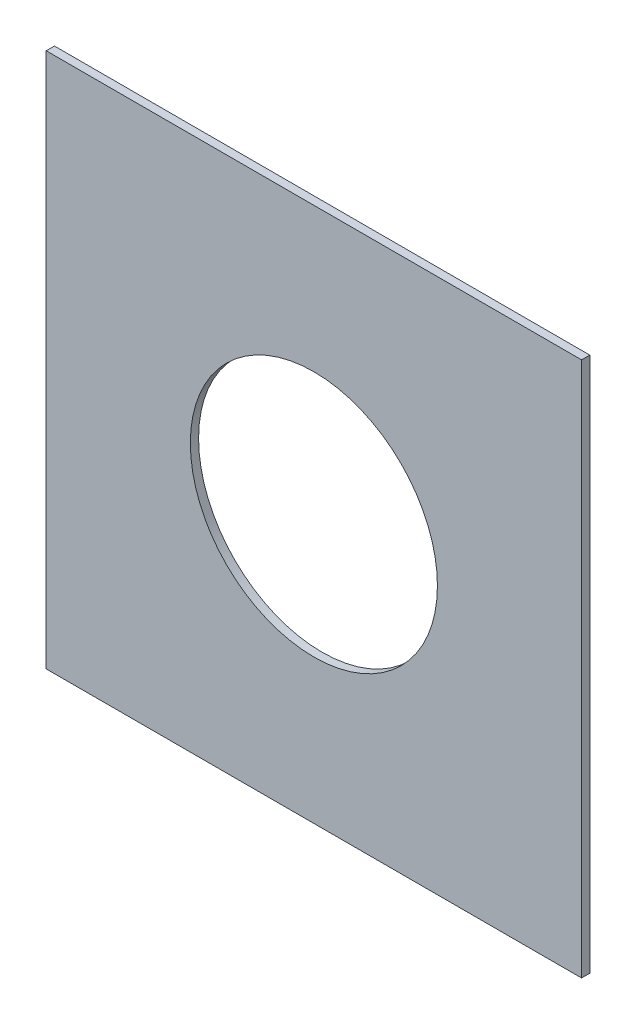
ISO-10303-21;
HEADER;
FILE_DESCRIPTION(('STEP AP214'),'2;1');
FILE_NAME('part.step','',(''),(''),'','','');
FILE_SCHEMA(('AUTOMOTIVE_DESIGN { 1 0 10303 214 1 1 1 1 }'));
ENDSEC;
DATA;
#1=APPLICATION_CONTEXT('core data for automotive mechanical design processes');
#2=APPLICATION_PROTOCOL_DEFINITION('international standard','automotive_design',2000,#1);
#3=PRODUCT_CONTEXT('',#1,'mechanical');
#4=PRODUCT('Part','Part','',(#3));
#5=PRODUCT_RELATED_PRODUCT_CATEGORY('part','',(#4));
#6=PRODUCT_DEFINITION_FORMATION('','',#4);
#7=PRODUCT_DEFINITION_CONTEXT('part definition',#1,'design');
#8=PRODUCT_DEFINITION('design','',#6,#7);
#9=PRODUCT_DEFINITION_SHAPE('','',#8);
#10=(LENGTH_UNIT() NAMED_UNIT(*) SI_UNIT(.MILLI.,.METRE.));
#11=(NAMED_UNIT(*) PLANE_ANGLE_UNIT() SI_UNIT($,.RADIAN.));
#12=(NAMED_UNIT(*) SI_UNIT($,.STERADIAN.) SOLID_ANGLE_UNIT());
#13=UNCERTAINTY_MEASURE_WITH_UNIT(LENGTH_MEASURE(1.E-05),#10,'distance_accuracy_value','');
#14=(GEOMETRIC_REPRESENTATION_CONTEXT(3) GLOBAL_UNCERTAINTY_ASSIGNED_CONTEXT((#13)) GLOBAL_UNIT_ASSIGNED_CONTEXT((#10,
#11,#12)) REPRESENTATION_CONTEXT('',''));
#15=CARTESIAN_POINT('',(0.,0.,0.));
#16=DIRECTION('',(0.,0.,1.));
#17=DIRECTION('',(1.,0.,0.));
#18=AXIS2_PLACEMENT_3D('',#15,#16,#17);
#19=CARTESIAN_POINT('',(3.024,4.85,-6.999));
#20=DIRECTION('',(0.,1.,0.));
#21=DIRECTION('',(1.,0.,0.));
#22=AXIS2_PLACEMENT_3D('',#19,#20,#21);
#23=PLANE('',#22);
#24=DIRECTION('',(0.,0.,1.));
#25=VECTOR('',#24,1.);
#26=CARTESIAN_POINT('',(4.325,4.85,-7.01));
#27=LINE('',#26,#25);
#28=CARTESIAN_POINT('',(4.325,4.85,-7.02));
#29=VERTEX_POINT('',#28);
#30=CARTESIAN_POINT('',(4.325,4.85,-7.));
#31=VERTEX_POINT('',#30);
#32=EDGE_CURVE('E62',#29,#31,#27,.T.);
#33=ORIENTED_EDGE('',*,*,#32,.F.);
#34=DIRECTION('',(1.,0.,0.));
#35=VECTOR('',#34,1.);
#36=CARTESIAN_POINT('',(3.675,4.85,-7.02));
#37=LINE('',#36,#35);
#38=CARTESIAN_POINT('',(3.025,4.85,-7.02));
#39=VERTEX_POINT('',#38);
#40=EDGE_CURVE('E87',#39,#29,#37,.T.);
#41=ORIENTED_EDGE('',*,*,#40,.F.);
#42=DIRECTION('',(0.,0.,-1.));
#43=VECTOR('',#42,1.);
#44=CARTESIAN_POINT('',(3.025,4.85,-7.01));
#45=LINE('',#44,#43);
#46=CARTESIAN_POINT('',(3.025,4.85,-7.));
#47=VERTEX_POINT('',#46);
#48=EDGE_CURVE('E73',#47,#39,#45,.T.);
#49=ORIENTED_EDGE('',*,*,#48,.F.);
#50=DIRECTION('',(-1.,0.,0.));
#51=VECTOR('',#50,1.);
#52=CARTESIAN_POINT('',(3.675,4.85,-7.));
#53=LINE('',#52,#51);
#54=EDGE_CURVE('E56',#31,#47,#53,.T.);
#55=ORIENTED_EDGE('',*,*,#54,.F.);
#56=EDGE_LOOP('',(#33,#41,#49,#55));
#57=FACE_BOUND('',#56,.T.);
#58=ADVANCED_FACE('F17',(#57),#23,.T.);
#59=CARTESIAN_POINT('',(4.325,4.851,-6.999));
#60=DIRECTION('',(1.,0.,0.));
#61=DIRECTION('',(0.,-1.,0.));
#62=AXIS2_PLACEMENT_3D('',#59,#60,#61);
#63=PLANE('',#62);
#64=DIRECTION('',(0.,0.,-1.));
#65=VECTOR('',#64,1.);
#66=CARTESIAN_POINT('',(4.325,3.55,-7.01));
#67=LINE('',#66,#65);
#68=CARTESIAN_POINT('',(4.325,3.55,-7.));
#69=VERTEX_POINT('',#68);
#70=CARTESIAN_POINT('',(4.325,3.55,-7.02));
#71=VERTEX_POINT('',#70);
#72=EDGE_CURVE('E71',#69,#71,#67,.T.);
#73=ORIENTED_EDGE('',*,*,#72,.T.);
#74=DIRECTION('',(0.,-1.,0.));
#75=VECTOR('',#74,1.);
#76=CARTESIAN_POINT('',(4.325,4.2,-7.02));
#77=LINE('',#76,#75);
#78=EDGE_CURVE('E67',#29,#71,#77,.T.);
#79=ORIENTED_EDGE('',*,*,#78,.F.);
#80=ORIENTED_EDGE('',*,*,#32,.T.);
#81=DIRECTION('',(0.,1.,0.));
#82=VECTOR('',#81,1.);
#83=CARTESIAN_POINT('',(4.325,4.2,-7.));
#84=LINE('',#83,#82);
#85=EDGE_CURVE('E64',#69,#31,#84,.T.);
#86=ORIENTED_EDGE('',*,*,#85,.F.);
#87=EDGE_LOOP('',(#73,#79,#80,#86));
#88=FACE_BOUND('',#87,.T.);
#89=ADVANCED_FACE('F63',(#88),#63,.T.);
#90=CARTESIAN_POINT('',(3.675,4.2,-7.));
#91=DIRECTION('',(0.,0.,-1.));
#92=DIRECTION('',(0.,1.,0.));
#93=AXIS2_PLACEMENT_3D('',#90,#91,#92);
#94=CYLINDRICAL_SURFACE('',#93,0.3);
#95=CARTESIAN_POINT('',(3.675,4.2,-7.02));
#96=DIRECTION('',(0.,0.,-1.));
#97=DIRECTION('',(0.,1.,0.));
#98=AXIS2_PLACEMENT_3D('',#95,#96,#97);
#99=CIRCLE('',#98,0.3);
#100=CARTESIAN_POINT('',(3.675,4.5,-7.02));
#101=VERTEX_POINT('',#100);
#102=EDGE_CURVE('E82',#101,#101,#99,.F.);
#103=ORIENTED_EDGE('',*,*,#102,.F.);
#104=EDGE_LOOP('',(#103));
#105=FACE_BOUND('',#104,.T.);
#106=CARTESIAN_POINT('',(3.675,4.2,-7.));
#107=DIRECTION('',(0.,0.,-1.));
#108=DIRECTION('',(0.,1.,0.));
#109=AXIS2_PLACEMENT_3D('',#106,#107,#108);
#110=CIRCLE('',#109,0.3);
#111=CARTESIAN_POINT('',(3.675,4.5,-7.));
#112=VERTEX_POINT('',#111);
#113=EDGE_CURVE('E21',#112,#112,#110,.T.);
#114=ORIENTED_EDGE('',*,*,#113,.F.);
#115=EDGE_LOOP('',(#114));
#116=FACE_BOUND('',#115,.T.);
#117=ADVANCED_FACE('F99',(#105,#116),#94,.F.);
#118=CARTESIAN_POINT('',(4.326,4.851,-7.));
#119=DIRECTION('',(0.,0.,1.));
#120=DIRECTION('',(-1.,0.,0.));
#121=AXIS2_PLACEMENT_3D('',#118,#119,#120);
#122=PLANE('',#121);
#123=ORIENTED_EDGE('',*,*,#113,.T.);
#124=EDGE_LOOP('',(#123));
#125=FACE_BOUND('',#124,.T.);
#126=DIRECTION('',(0.,1.,0.));
#127=VECTOR('',#126,1.);
#128=CARTESIAN_POINT('',(3.025,4.2,-7.));
#129=LINE('',#128,#127);
#130=CARTESIAN_POINT('',(3.025,3.55,-7.));
#131=VERTEX_POINT('',#130);
#132=EDGE_CURVE('E94',#131,#47,#129,.T.);
#133=ORIENTED_EDGE('',*,*,#132,.F.);
#134=DIRECTION('',(-1.,0.,0.));
#135=VECTOR('',#134,1.);
#136=CARTESIAN_POINT('',(3.675,3.55,-7.));
#137=LINE('',#136,#135);
#138=EDGE_CURVE('E78',#69,#131,#137,.T.);
#139=ORIENTED_EDGE('',*,*,#138,.F.);
#140=ORIENTED_EDGE('',*,*,#85,.T.);
#141=ORIENTED_EDGE('',*,*,#54,.T.);
#142=EDGE_LOOP('',(#133,#139,#140,#141));
#143=FACE_BOUND('',#142,.T.);
#144=ADVANCED_FACE('F76',(#125,#143),#122,.T.);
#145=CARTESIAN_POINT('',(3.025,3.549,-6.999));
#146=DIRECTION('',(-1.,0.,0.));
#147=DIRECTION('',(0.,1.,0.));
#148=AXIS2_PLACEMENT_3D('',#145,#146,#147);
#149=PLANE('',#148);
#150=ORIENTED_EDGE('',*,*,#48,.T.);
#151=DIRECTION('',(0.,1.,0.));
#152=VECTOR('',#151,1.);
#153=CARTESIAN_POINT('',(3.025,4.2,-7.02));
#154=LINE('',#153,#152);
#155=CARTESIAN_POINT('',(3.025,3.55,-7.02));
#156=VERTEX_POINT('',#155);
#157=EDGE_CURVE('E36',#156,#39,#154,.T.);
#158=ORIENTED_EDGE('',*,*,#157,.F.);
#159=DIRECTION('',(0.,0.,-1.));
#160=VECTOR('',#159,1.);
#161=CARTESIAN_POINT('',(3.025,3.55,-7.01));
#162=LINE('',#161,#160);
#163=EDGE_CURVE('E27',#131,#156,#162,.T.);
#164=ORIENTED_EDGE('',*,*,#163,.F.);
#165=ORIENTED_EDGE('',*,*,#132,.T.);
#166=EDGE_LOOP('',(#150,#158,#164,#165));
#167=FACE_BOUND('',#166,.T.);
#168=ADVANCED_FACE('F108',(#167),#149,.T.);
#169=CARTESIAN_POINT('',(3.024,4.851,-7.02));
#170=DIRECTION('',(0.,0.,-1.));
#171=DIRECTION('',(1.,0.,0.));
#172=AXIS2_PLACEMENT_3D('',#169,#170,#171);
#173=PLANE('',#172);
#174=ORIENTED_EDGE('',*,*,#102,.T.);
#175=EDGE_LOOP('',(#174));
#176=FACE_BOUND('',#175,.T.);
#177=ORIENTED_EDGE('',*,*,#40,.T.);
#178=ORIENTED_EDGE('',*,*,#78,.T.);
#179=DIRECTION('',(1.,0.,0.));
#180=VECTOR('',#179,1.);
#181=CARTESIAN_POINT('',(3.675,3.55,-7.02));
#182=LINE('',#181,#180);
#183=EDGE_CURVE('E11',#156,#71,#182,.T.);
#184=ORIENTED_EDGE('',*,*,#183,.F.);
#185=ORIENTED_EDGE('',*,*,#157,.T.);
#186=EDGE_LOOP('',(#177,#178,#184,#185));
#187=FACE_BOUND('',#186,.T.);
#188=ADVANCED_FACE('F112',(#176,#187),#173,.T.);
#189=CARTESIAN_POINT('',(4.326,3.55,-6.999));
#190=DIRECTION('',(0.,-1.,0.));
#191=DIRECTION('',(-1.,0.,0.));
#192=AXIS2_PLACEMENT_3D('',#189,#190,#191);
#193=PLANE('',#192);
#194=ORIENTED_EDGE('',*,*,#163,.T.);
#195=ORIENTED_EDGE('',*,*,#183,.T.);
#196=ORIENTED_EDGE('',*,*,#72,.F.);
#197=ORIENTED_EDGE('',*,*,#138,.T.);
#198=EDGE_LOOP('',(#194,#195,#196,#197));
#199=FACE_BOUND('',#198,.T.);
#200=ADVANCED_FACE('F19',(#199),#193,.T.);
#201=CLOSED_SHELL('',(#58,#89,#117,#144,#168,#188,#200));
#202=MANIFOLD_SOLID_BREP('B1',#201);
#203=ADVANCED_BREP_SHAPE_REPRESENTATION('',(#18,#202),#14);
#204=SHAPE_DEFINITION_REPRESENTATION(#9,#203);
ENDSEC;
END-ISO-10303-21;
